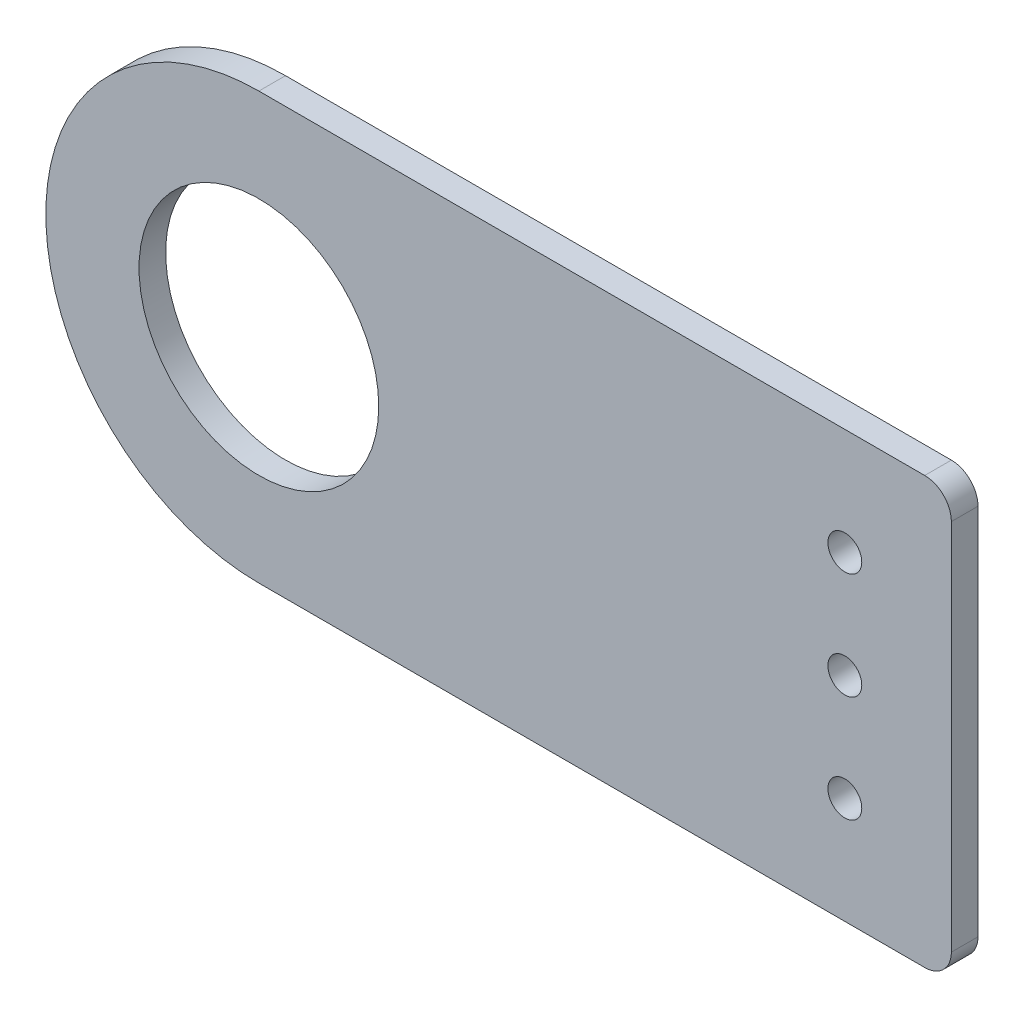
ISO-10303-21;
HEADER;
FILE_DESCRIPTION(('STEP AP214'),'2;1');
FILE_NAME('part.step','',(''),(''),'','','');
FILE_SCHEMA(('AUTOMOTIVE_DESIGN { 1 0 10303 214 1 1 1 1 }'));
ENDSEC;
DATA;
#1=APPLICATION_CONTEXT('core data for automotive mechanical design processes');
#2=APPLICATION_PROTOCOL_DEFINITION('international standard','automotive_design',2000,#1);
#3=PRODUCT_CONTEXT('',#1,'mechanical');
#4=PRODUCT('Part','Part','',(#3));
#5=PRODUCT_RELATED_PRODUCT_CATEGORY('part','',(#4));
#6=PRODUCT_DEFINITION_FORMATION('','',#4);
#7=PRODUCT_DEFINITION_CONTEXT('part definition',#1,'design');
#8=PRODUCT_DEFINITION('design','',#6,#7);
#9=PRODUCT_DEFINITION_SHAPE('','',#8);
#10=(LENGTH_UNIT() NAMED_UNIT(*) SI_UNIT(.MILLI.,.METRE.));
#11=(NAMED_UNIT(*) PLANE_ANGLE_UNIT() SI_UNIT($,.RADIAN.));
#12=(NAMED_UNIT(*) SI_UNIT($,.STERADIAN.) SOLID_ANGLE_UNIT());
#13=UNCERTAINTY_MEASURE_WITH_UNIT(LENGTH_MEASURE(1.E-05),#10,'distance_accuracy_value','');
#14=(GEOMETRIC_REPRESENTATION_CONTEXT(3) GLOBAL_UNCERTAINTY_ASSIGNED_CONTEXT((#13)) GLOBAL_UNIT_ASSIGNED_CONTEXT((#10,
#11,#12)) REPRESENTATION_CONTEXT('',''));
#15=CARTESIAN_POINT('',(0.,0.,0.));
#16=DIRECTION('',(0.,0.,1.));
#17=DIRECTION('',(1.,0.,0.));
#18=AXIS2_PLACEMENT_3D('',#15,#16,#17);
#19=CARTESIAN_POINT('',(-69.85,-12.7,3.175));
#20=DIRECTION('',(0.,0.,-1.));
#21=DIRECTION('',(-1.,0.,0.));
#22=AXIS2_PLACEMENT_3D('',#19,#20,#21);
#23=PLANE('',#22);
#24=DIRECTION('',(1.,0.,0.));
#25=VECTOR('',#24,1.);
#26=CARTESIAN_POINT('',(-69.85,-38.1,3.175));
#27=LINE('',#26,#25);
#28=CARTESIAN_POINT('',(-69.85,-38.1,3.175));
#29=VERTEX_POINT('',#28);
#30=CARTESIAN_POINT('',(9.52499999999999,-38.1,3.175));
#31=VERTEX_POINT('',#30);
#32=EDGE_CURVE('E90',#29,#31,#27,.T.);
#33=ORIENTED_EDGE('',*,*,#32,.T.);
#34=CARTESIAN_POINT('',(9.525,-34.925,3.175));
#35=DIRECTION('',(0.,0.,-1.));
#36=DIRECTION('',(-1.,0.,0.));
#37=AXIS2_PLACEMENT_3D('',#34,#35,#36);
#38=CIRCLE('',#37,3.175);
#39=CARTESIAN_POINT('',(12.7,-34.925,3.175));
#40=VERTEX_POINT('',#39);
#41=EDGE_CURVE('E45',#31,#40,#38,.F.);
#42=ORIENTED_EDGE('',*,*,#41,.T.);
#43=DIRECTION('',(0.,1.,0.));
#44=VECTOR('',#43,1.);
#45=CARTESIAN_POINT('',(12.7,-38.1,3.175));
#46=LINE('',#45,#44);
#47=CARTESIAN_POINT('',(12.7,9.525,3.175));
#48=VERTEX_POINT('',#47);
#49=EDGE_CURVE('E97',#40,#48,#46,.T.);
#50=ORIENTED_EDGE('',*,*,#49,.T.);
#51=CARTESIAN_POINT('',(9.52499999999999,9.525,3.175));
#52=DIRECTION('',(0.,0.,-1.));
#53=DIRECTION('',(-1.,0.,0.));
#54=AXIS2_PLACEMENT_3D('',#51,#52,#53);
#55=CIRCLE('',#54,3.175);
#56=CARTESIAN_POINT('',(9.52499999999999,12.7,3.175));
#57=VERTEX_POINT('',#56);
#58=EDGE_CURVE('E52',#48,#57,#55,.F.);
#59=ORIENTED_EDGE('',*,*,#58,.T.);
#60=DIRECTION('',(-1.,0.,0.));
#61=VECTOR('',#60,1.);
#62=CARTESIAN_POINT('',(-69.85,12.7,3.175));
#63=LINE('',#62,#61);
#64=CARTESIAN_POINT('',(-69.85,12.7,3.175));
#65=VERTEX_POINT('',#64);
#66=EDGE_CURVE('E102',#57,#65,#63,.T.);
#67=ORIENTED_EDGE('',*,*,#66,.T.);
#68=CARTESIAN_POINT('',(-69.85,-12.7,3.175));
#69=DIRECTION('',(0.,0.,1.));
#70=DIRECTION('',(-1.,0.,0.));
#71=AXIS2_PLACEMENT_3D('',#68,#69,#70);
#72=CIRCLE('',#71,25.4);
#73=EDGE_CURVE('E98',#65,#29,#72,.T.);
#74=ORIENTED_EDGE('',*,*,#73,.T.);
#75=EDGE_LOOP('',(#33,#42,#50,#59,#67,#74));
#76=FACE_BOUND('',#75,.T.);
#77=CARTESIAN_POINT('',(0.,0.,3.175));
#78=DIRECTION('',(0.,0.,1.));
#79=DIRECTION('',(1.,0.,0.));
#80=AXIS2_PLACEMENT_3D('',#77,#78,#79);
#81=CIRCLE('',#80,2.0193);
#82=CARTESIAN_POINT('',(2.0193,0.,3.175));
#83=VERTEX_POINT('',#82);
#84=EDGE_CURVE('E143',#83,#83,#81,.T.);
#85=ORIENTED_EDGE('',*,*,#84,.F.);
#86=EDGE_LOOP('',(#85));
#87=FACE_BOUND('',#86,.T.);
#88=CARTESIAN_POINT('',(-69.85,-12.7,3.175));
#89=DIRECTION('',(0.,0.,1.));
#90=DIRECTION('',(1.,0.,0.));
#91=AXIS2_PLACEMENT_3D('',#88,#89,#90);
#92=CIRCLE('',#91,14.2875);
#93=CARTESIAN_POINT('',(-55.5625,-12.7,3.175));
#94=VERTEX_POINT('',#93);
#95=EDGE_CURVE('E272',#94,#94,#92,.T.);
#96=ORIENTED_EDGE('',*,*,#95,.F.);
#97=EDGE_LOOP('',(#96));
#98=FACE_BOUND('',#97,.T.);
#99=CARTESIAN_POINT('',(0.,-12.7,3.175));
#100=DIRECTION('',(0.,0.,1.));
#101=DIRECTION('',(1.,0.,0.));
#102=AXIS2_PLACEMENT_3D('',#99,#100,#101);
#103=CIRCLE('',#102,2.0193);
#104=CARTESIAN_POINT('',(2.0193,-12.7,3.175));
#105=VERTEX_POINT('',#104);
#106=EDGE_CURVE('E266',#105,#105,#103,.T.);
#107=ORIENTED_EDGE('',*,*,#106,.F.);
#108=EDGE_LOOP('',(#107));
#109=FACE_BOUND('',#108,.T.);
#110=CARTESIAN_POINT('',(0.,-25.4,3.175));
#111=DIRECTION('',(0.,0.,1.));
#112=DIRECTION('',(1.,0.,0.));
#113=AXIS2_PLACEMENT_3D('',#110,#111,#112);
#114=CIRCLE('',#113,2.0193);
#115=CARTESIAN_POINT('',(2.0193,-25.4,3.175));
#116=VERTEX_POINT('',#115);
#117=EDGE_CURVE('E257',#116,#116,#114,.T.);
#118=ORIENTED_EDGE('',*,*,#117,.F.);
#119=EDGE_LOOP('',(#118));
#120=FACE_BOUND('',#119,.T.);
#121=ADVANCED_FACE('F37',(#76,#87,#98,#109,#120),#23,.F.);
#122=CARTESIAN_POINT('',(-69.85,-12.7,0.));
#123=DIRECTION('',(0.,0.,-1.));
#124=DIRECTION('',(-1.,0.,0.));
#125=AXIS2_PLACEMENT_3D('',#122,#123,#124);
#126=PLANE('',#125);
#127=CARTESIAN_POINT('',(0.,-12.7,0.));
#128=DIRECTION('',(0.,0.,1.));
#129=DIRECTION('',(1.,0.,0.));
#130=AXIS2_PLACEMENT_3D('',#127,#128,#129);
#131=CIRCLE('',#130,2.0193);
#132=CARTESIAN_POINT('',(2.0193,-12.7,0.));
#133=VERTEX_POINT('',#132);
#134=EDGE_CURVE('E263',#133,#133,#131,.T.);
#135=ORIENTED_EDGE('',*,*,#134,.T.);
#136=EDGE_LOOP('',(#135));
#137=FACE_BOUND('',#136,.T.);
#138=CARTESIAN_POINT('',(0.,0.,0.));
#139=DIRECTION('',(0.,0.,1.));
#140=DIRECTION('',(1.,0.,0.));
#141=AXIS2_PLACEMENT_3D('',#138,#139,#140);
#142=CIRCLE('',#141,2.0193);
#143=CARTESIAN_POINT('',(2.0193,0.,0.));
#144=VERTEX_POINT('',#143);
#145=EDGE_CURVE('E275',#144,#144,#142,.T.);
#146=ORIENTED_EDGE('',*,*,#145,.T.);
#147=EDGE_LOOP('',(#146));
#148=FACE_BOUND('',#147,.T.);
#149=DIRECTION('',(0.,1.,0.));
#150=VECTOR('',#149,1.);
#151=CARTESIAN_POINT('',(12.7,-38.1,0.));
#152=LINE('',#151,#150);
#153=CARTESIAN_POINT('',(12.7,-34.925,0.));
#154=VERTEX_POINT('',#153);
#155=CARTESIAN_POINT('',(12.7,9.525,0.));
#156=VERTEX_POINT('',#155);
#157=EDGE_CURVE('E140',#154,#156,#152,.T.);
#158=ORIENTED_EDGE('',*,*,#157,.F.);
#159=CARTESIAN_POINT('',(9.525,-34.925,0.));
#160=DIRECTION('',(0.,0.,-1.));
#161=DIRECTION('',(-1.,0.,0.));
#162=AXIS2_PLACEMENT_3D('',#159,#160,#161);
#163=CIRCLE('',#162,3.175);
#164=CARTESIAN_POINT('',(9.52499999999999,-38.1,0.));
#165=VERTEX_POINT('',#164);
#166=EDGE_CURVE('E123',#154,#165,#163,.T.);
#167=ORIENTED_EDGE('',*,*,#166,.T.);
#168=DIRECTION('',(1.,0.,0.));
#169=VECTOR('',#168,1.);
#170=CARTESIAN_POINT('',(-69.85,-38.1,0.));
#171=LINE('',#170,#169);
#172=CARTESIAN_POINT('',(-69.85,-38.1,0.));
#173=VERTEX_POINT('',#172);
#174=EDGE_CURVE('E139',#173,#165,#171,.T.);
#175=ORIENTED_EDGE('',*,*,#174,.F.);
#176=CARTESIAN_POINT('',(-69.85,-12.7,0.));
#177=DIRECTION('',(0.,0.,1.));
#178=DIRECTION('',(-1.,0.,0.));
#179=AXIS2_PLACEMENT_3D('',#176,#177,#178);
#180=CIRCLE('',#179,25.4);
#181=CARTESIAN_POINT('',(-69.85,12.7,0.));
#182=VERTEX_POINT('',#181);
#183=EDGE_CURVE('E110',#182,#173,#180,.T.);
#184=ORIENTED_EDGE('',*,*,#183,.F.);
#185=DIRECTION('',(-1.,0.,0.));
#186=VECTOR('',#185,1.);
#187=CARTESIAN_POINT('',(-69.85,12.7,0.));
#188=LINE('',#187,#186);
#189=CARTESIAN_POINT('',(9.52499999999999,12.7,0.));
#190=VERTEX_POINT('',#189);
#191=EDGE_CURVE('E106',#190,#182,#188,.T.);
#192=ORIENTED_EDGE('',*,*,#191,.F.);
#193=CARTESIAN_POINT('',(9.52499999999999,9.525,0.));
#194=DIRECTION('',(0.,0.,-1.));
#195=DIRECTION('',(-1.,0.,0.));
#196=AXIS2_PLACEMENT_3D('',#193,#194,#195);
#197=CIRCLE('',#196,3.175);
#198=EDGE_CURVE('E121',#190,#156,#197,.T.);
#199=ORIENTED_EDGE('',*,*,#198,.T.);
#200=EDGE_LOOP('',(#158,#167,#175,#184,#192,#199));
#201=FACE_BOUND('',#200,.T.);
#202=CARTESIAN_POINT('',(-69.85,-12.7,0.));
#203=DIRECTION('',(0.,0.,1.));
#204=DIRECTION('',(1.,0.,0.));
#205=AXIS2_PLACEMENT_3D('',#202,#203,#204);
#206=CIRCLE('',#205,14.2875);
#207=CARTESIAN_POINT('',(-55.5625,-12.7,0.));
#208=VERTEX_POINT('',#207);
#209=EDGE_CURVE('E269',#208,#208,#206,.T.);
#210=ORIENTED_EDGE('',*,*,#209,.T.);
#211=EDGE_LOOP('',(#210));
#212=FACE_BOUND('',#211,.T.);
#213=CARTESIAN_POINT('',(0.,-25.4,0.));
#214=DIRECTION('',(0.,0.,1.));
#215=DIRECTION('',(1.,0.,0.));
#216=AXIS2_PLACEMENT_3D('',#213,#214,#215);
#217=CIRCLE('',#216,2.0193);
#218=CARTESIAN_POINT('',(2.0193,-25.4,0.));
#219=VERTEX_POINT('',#218);
#220=EDGE_CURVE('E260',#219,#219,#217,.T.);
#221=ORIENTED_EDGE('',*,*,#220,.T.);
#222=EDGE_LOOP('',(#221));
#223=FACE_BOUND('',#222,.T.);
#224=ADVANCED_FACE('F137',(#137,#148,#201,#212,#223),#126,.T.);
#225=CARTESIAN_POINT('',(-69.85,-12.7,3.175));
#226=DIRECTION('',(0.,0.,-1.));
#227=DIRECTION('',(-1.,0.,0.));
#228=AXIS2_PLACEMENT_3D('',#225,#226,#227);
#229=CYLINDRICAL_SURFACE('',#228,25.4);
#230=ORIENTED_EDGE('',*,*,#183,.T.);
#231=DIRECTION('',(0.,0.,-1.));
#232=VECTOR('',#231,1.);
#233=CARTESIAN_POINT('',(-69.85,-38.1,3.175));
#234=LINE('',#233,#232);
#235=EDGE_CURVE('E94',#29,#173,#234,.T.);
#236=ORIENTED_EDGE('',*,*,#235,.F.);
#237=ORIENTED_EDGE('',*,*,#73,.F.);
#238=DIRECTION('',(0.,0.,-1.));
#239=VECTOR('',#238,1.);
#240=CARTESIAN_POINT('',(-69.85,12.7,3.175));
#241=LINE('',#240,#239);
#242=EDGE_CURVE('E112',#65,#182,#241,.T.);
#243=ORIENTED_EDGE('',*,*,#242,.T.);
#244=EDGE_LOOP('',(#230,#236,#237,#243));
#245=FACE_BOUND('',#244,.T.);
#246=ADVANCED_FACE('F108',(#245),#229,.T.);
#247=CARTESIAN_POINT('',(-69.85,-38.1,3.175));
#248=DIRECTION('',(0.,1.,0.));
#249=DIRECTION('',(0.,0.,1.));
#250=AXIS2_PLACEMENT_3D('',#247,#248,#249);
#251=PLANE('',#250);
#252=ORIENTED_EDGE('',*,*,#174,.T.);
#253=DIRECTION('',(0.,0.,-1.));
#254=VECTOR('',#253,1.);
#255=CARTESIAN_POINT('',(9.52499999999999,-38.1,3.175));
#256=LINE('',#255,#254);
#257=EDGE_CURVE('E60',#165,#31,#256,.F.);
#258=ORIENTED_EDGE('',*,*,#257,.T.);
#259=ORIENTED_EDGE('',*,*,#32,.F.);
#260=ORIENTED_EDGE('',*,*,#235,.T.);
#261=EDGE_LOOP('',(#252,#258,#259,#260));
#262=FACE_BOUND('',#261,.T.);
#263=ADVANCED_FACE('F92',(#262),#251,.F.);
#264=CARTESIAN_POINT('',(12.7,-38.1,3.175));
#265=DIRECTION('',(-1.,0.,0.));
#266=DIRECTION('',(0.,0.,1.));
#267=AXIS2_PLACEMENT_3D('',#264,#265,#266);
#268=PLANE('',#267);
#269=ORIENTED_EDGE('',*,*,#49,.F.);
#270=DIRECTION('',(0.,0.,-1.));
#271=VECTOR('',#270,1.);
#272=CARTESIAN_POINT('',(12.7,-34.925,3.175));
#273=LINE('',#272,#271);
#274=EDGE_CURVE('E114',#40,#154,#273,.T.);
#275=ORIENTED_EDGE('',*,*,#274,.T.);
#276=ORIENTED_EDGE('',*,*,#157,.T.);
#277=DIRECTION('',(0.,0.,-1.));
#278=VECTOR('',#277,1.);
#279=CARTESIAN_POINT('',(12.7,9.525,3.175));
#280=LINE('',#279,#278);
#281=EDGE_CURVE('E111',#156,#48,#280,.F.);
#282=ORIENTED_EDGE('',*,*,#281,.T.);
#283=EDGE_LOOP('',(#269,#275,#276,#282));
#284=FACE_BOUND('',#283,.T.);
#285=ADVANCED_FACE('F130',(#284),#268,.F.);
#286=CARTESIAN_POINT('',(-69.85,12.7,3.175));
#287=DIRECTION('',(0.,-1.,0.));
#288=DIRECTION('',(0.,0.,-1.));
#289=AXIS2_PLACEMENT_3D('',#286,#287,#288);
#290=PLANE('',#289);
#291=ORIENTED_EDGE('',*,*,#66,.F.);
#292=DIRECTION('',(0.,0.,-1.));
#293=VECTOR('',#292,1.);
#294=CARTESIAN_POINT('',(9.52499999999999,12.7,3.175));
#295=LINE('',#294,#293);
#296=EDGE_CURVE('E11',#57,#190,#295,.T.);
#297=ORIENTED_EDGE('',*,*,#296,.T.);
#298=ORIENTED_EDGE('',*,*,#191,.T.);
#299=ORIENTED_EDGE('',*,*,#242,.F.);
#300=EDGE_LOOP('',(#291,#297,#298,#299));
#301=FACE_BOUND('',#300,.T.);
#302=ADVANCED_FACE('F148',(#301),#290,.F.);
#303=CARTESIAN_POINT('',(0.,0.,3.175));
#304=DIRECTION('',(0.,0.,-1.));
#305=DIRECTION('',(-1.,0.,0.));
#306=AXIS2_PLACEMENT_3D('',#303,#304,#305);
#307=CYLINDRICAL_SURFACE('',#306,2.0193);
#308=ORIENTED_EDGE('',*,*,#84,.T.);
#309=EDGE_LOOP('',(#308));
#310=FACE_BOUND('',#309,.T.);
#311=ORIENTED_EDGE('',*,*,#145,.F.);
#312=EDGE_LOOP('',(#311));
#313=FACE_BOUND('',#312,.T.);
#314=ADVANCED_FACE('F164',(#310,#313),#307,.F.);
#315=CARTESIAN_POINT('',(-69.85,-12.7,3.175));
#316=DIRECTION('',(0.,0.,-1.));
#317=DIRECTION('',(-1.,0.,0.));
#318=AXIS2_PLACEMENT_3D('',#315,#316,#317);
#319=CYLINDRICAL_SURFACE('',#318,14.2875);
#320=ORIENTED_EDGE('',*,*,#95,.T.);
#321=EDGE_LOOP('',(#320));
#322=FACE_BOUND('',#321,.T.);
#323=ORIENTED_EDGE('',*,*,#209,.F.);
#324=EDGE_LOOP('',(#323));
#325=FACE_BOUND('',#324,.T.);
#326=ADVANCED_FACE('F197',(#322,#325),#319,.F.);
#327=CARTESIAN_POINT('',(0.,-12.7,3.175));
#328=DIRECTION('',(0.,0.,-1.));
#329=DIRECTION('',(-1.,0.,0.));
#330=AXIS2_PLACEMENT_3D('',#327,#328,#329);
#331=CYLINDRICAL_SURFACE('',#330,2.0193);
#332=ORIENTED_EDGE('',*,*,#106,.T.);
#333=EDGE_LOOP('',(#332));
#334=FACE_BOUND('',#333,.T.);
#335=ORIENTED_EDGE('',*,*,#134,.F.);
#336=EDGE_LOOP('',(#335));
#337=FACE_BOUND('',#336,.T.);
#338=ADVANCED_FACE('F204',(#334,#337),#331,.F.);
#339=CARTESIAN_POINT('',(0.,-25.4,3.175));
#340=DIRECTION('',(0.,0.,-1.));
#341=DIRECTION('',(-1.,0.,0.));
#342=AXIS2_PLACEMENT_3D('',#339,#340,#341);
#343=CYLINDRICAL_SURFACE('',#342,2.0193);
#344=ORIENTED_EDGE('',*,*,#117,.T.);
#345=EDGE_LOOP('',(#344));
#346=FACE_BOUND('',#345,.T.);
#347=ORIENTED_EDGE('',*,*,#220,.F.);
#348=EDGE_LOOP('',(#347));
#349=FACE_BOUND('',#348,.T.);
#350=ADVANCED_FACE('F155',(#346,#349),#343,.F.);
#351=CARTESIAN_POINT('',(9.525,-34.925,3.175));
#352=DIRECTION('',(0.,0.,-1.));
#353=DIRECTION('',(-1.,0.,0.));
#354=AXIS2_PLACEMENT_3D('',#351,#352,#353);
#355=CYLINDRICAL_SURFACE('',#354,3.175);
#356=ORIENTED_EDGE('',*,*,#41,.F.);
#357=ORIENTED_EDGE('',*,*,#257,.F.);
#358=ORIENTED_EDGE('',*,*,#166,.F.);
#359=ORIENTED_EDGE('',*,*,#274,.F.);
#360=EDGE_LOOP('',(#356,#357,#358,#359));
#361=FACE_BOUND('',#360,.T.);
#362=ADVANCED_FACE('F135',(#361),#355,.T.);
#363=CARTESIAN_POINT('',(9.52499999999999,9.525,3.175));
#364=DIRECTION('',(0.,0.,-1.));
#365=DIRECTION('',(-1.,0.,0.));
#366=AXIS2_PLACEMENT_3D('',#363,#364,#365);
#367=CYLINDRICAL_SURFACE('',#366,3.175);
#368=ORIENTED_EDGE('',*,*,#58,.F.);
#369=ORIENTED_EDGE('',*,*,#281,.F.);
#370=ORIENTED_EDGE('',*,*,#198,.F.);
#371=ORIENTED_EDGE('',*,*,#296,.F.);
#372=EDGE_LOOP('',(#368,#369,#370,#371));
#373=FACE_BOUND('',#372,.T.);
#374=ADVANCED_FACE('F39',(#373),#367,.T.);
#375=CLOSED_SHELL('',(#121,#224,#246,#263,#285,#302,#314,#326,#338,#350,#362,#374));
#376=MANIFOLD_SOLID_BREP('B2',#375);
#377=ADVANCED_BREP_SHAPE_REPRESENTATION('',(#18,#376),#14);
#378=SHAPE_DEFINITION_REPRESENTATION(#9,#377);
ENDSEC;
END-ISO-10303-21;
